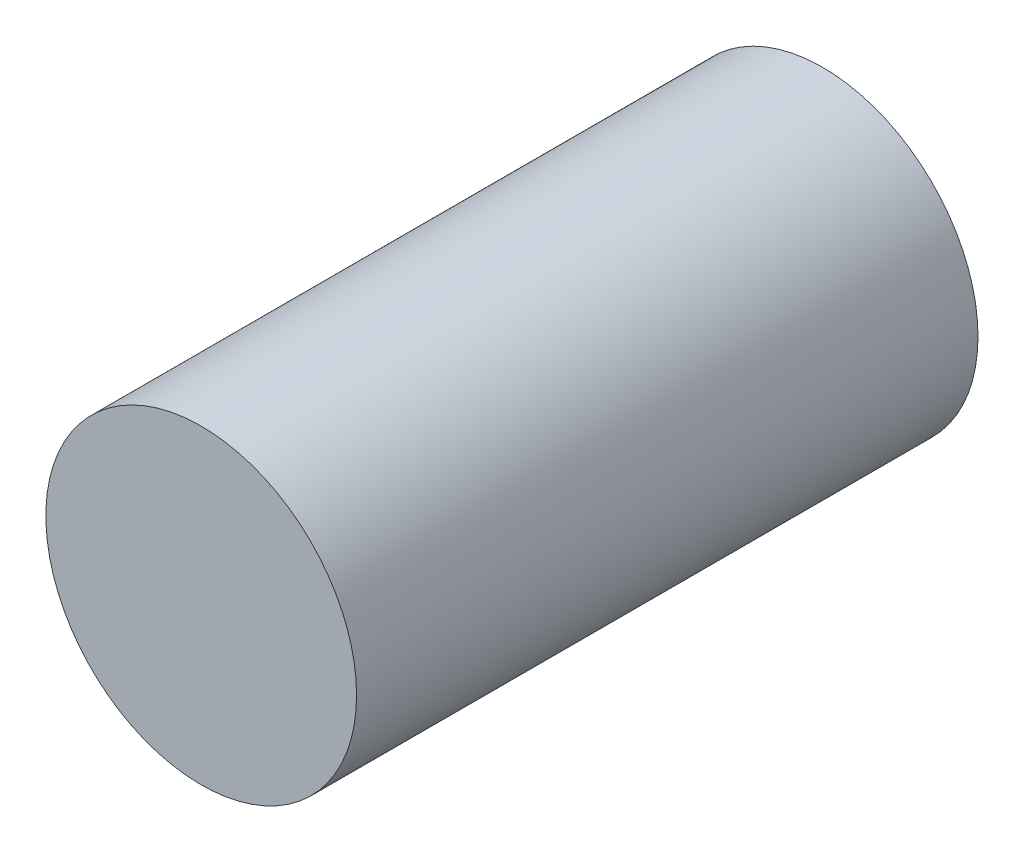
ISO-10303-21;
HEADER;
FILE_DESCRIPTION(('STEP AP214'),'2;1');
FILE_NAME('part.step','',(''),(''),'','','');
FILE_SCHEMA(('AUTOMOTIVE_DESIGN { 1 0 10303 214 1 1 1 1 }'));
ENDSEC;
DATA;
#1=APPLICATION_CONTEXT('core data for automotive mechanical design processes');
#2=APPLICATION_PROTOCOL_DEFINITION('international standard','automotive_design',2000,#1);
#3=PRODUCT_CONTEXT('',#1,'mechanical');
#4=PRODUCT('Part','Part','',(#3));
#5=PRODUCT_RELATED_PRODUCT_CATEGORY('part','',(#4));
#6=PRODUCT_DEFINITION_FORMATION('','',#4);
#7=PRODUCT_DEFINITION_CONTEXT('part definition',#1,'design');
#8=PRODUCT_DEFINITION('design','',#6,#7);
#9=PRODUCT_DEFINITION_SHAPE('','',#8);
#10=(LENGTH_UNIT() NAMED_UNIT(*) SI_UNIT(.MILLI.,.METRE.));
#11=(NAMED_UNIT(*) PLANE_ANGLE_UNIT() SI_UNIT($,.RADIAN.));
#12=(NAMED_UNIT(*) SI_UNIT($,.STERADIAN.) SOLID_ANGLE_UNIT());
#13=UNCERTAINTY_MEASURE_WITH_UNIT(LENGTH_MEASURE(1.E-05),#10,'distance_accuracy_value','');
#14=(GEOMETRIC_REPRESENTATION_CONTEXT(3) GLOBAL_UNCERTAINTY_ASSIGNED_CONTEXT((#13)) GLOBAL_UNIT_ASSIGNED_CONTEXT((#10,
#11,#12)) REPRESENTATION_CONTEXT('',''));
#15=CARTESIAN_POINT('',(0.,0.,0.));
#16=DIRECTION('',(0.,0.,1.));
#17=DIRECTION('',(1.,0.,0.));
#18=AXIS2_PLACEMENT_3D('',#15,#16,#17);
#19=CARTESIAN_POINT('',(475.,-150.,30.));
#20=DIRECTION('',(0.,0.,-1.));
#21=DIRECTION('',(-1.,0.,0.));
#22=AXIS2_PLACEMENT_3D('',#19,#20,#21);
#23=CYLINDRICAL_SURFACE('',#22,7.50000000000001);
#24=CARTESIAN_POINT('',(475.,-150.,30.));
#25=DIRECTION('',(0.,0.,1.));
#26=DIRECTION('',(1.,0.,0.));
#27=AXIS2_PLACEMENT_3D('',#24,#25,#26);
#28=CIRCLE('',#27,7.50000000000001);
#29=CARTESIAN_POINT('',(482.5,-150.,30.));
#30=VERTEX_POINT('',#29);
#31=EDGE_CURVE('E10',#30,#30,#28,.T.);
#32=ORIENTED_EDGE('',*,*,#31,.F.);
#33=EDGE_LOOP('',(#32));
#34=FACE_BOUND('',#33,.T.);
#35=CARTESIAN_POINT('',(475.,-150.,0.));
#36=DIRECTION('',(0.,0.,1.));
#37=DIRECTION('',(1.,0.,0.));
#38=AXIS2_PLACEMENT_3D('',#35,#36,#37);
#39=CIRCLE('',#38,7.50000000000001);
#40=CARTESIAN_POINT('',(482.5,-150.,0.));
#41=VERTEX_POINT('',#40);
#42=EDGE_CURVE('E32',#41,#41,#39,.T.);
#43=ORIENTED_EDGE('',*,*,#42,.T.);
#44=EDGE_LOOP('',(#43));
#45=FACE_BOUND('',#44,.T.);
#46=ADVANCED_FACE('F29',(#34,#45),#23,.T.);
#47=CARTESIAN_POINT('',(475.,-150.,30.));
#48=DIRECTION('',(0.,0.,1.));
#49=DIRECTION('',(1.,0.,0.));
#50=AXIS2_PLACEMENT_3D('',#47,#48,#49);
#51=PLANE('',#50);
#52=ORIENTED_EDGE('',*,*,#31,.T.);
#53=EDGE_LOOP('',(#52));
#54=FACE_BOUND('',#53,.T.);
#55=ADVANCED_FACE('F44',(#54),#51,.T.);
#56=CARTESIAN_POINT('',(475.,-150.,0.));
#57=DIRECTION('',(0.,0.,1.));
#58=DIRECTION('',(1.,0.,0.));
#59=AXIS2_PLACEMENT_3D('',#56,#57,#58);
#60=PLANE('',#59);
#61=ORIENTED_EDGE('',*,*,#42,.F.);
#62=EDGE_LOOP('',(#61));
#63=FACE_BOUND('',#62,.T.);
#64=ADVANCED_FACE('F42',(#63),#60,.F.);
#65=CLOSED_SHELL('',(#46,#55,#64));
#66=MANIFOLD_SOLID_BREP('B2',#65);
#67=ADVANCED_BREP_SHAPE_REPRESENTATION('',(#18,#66),#14);
#68=SHAPE_DEFINITION_REPRESENTATION(#9,#67);
ENDSEC;
END-ISO-10303-21;
